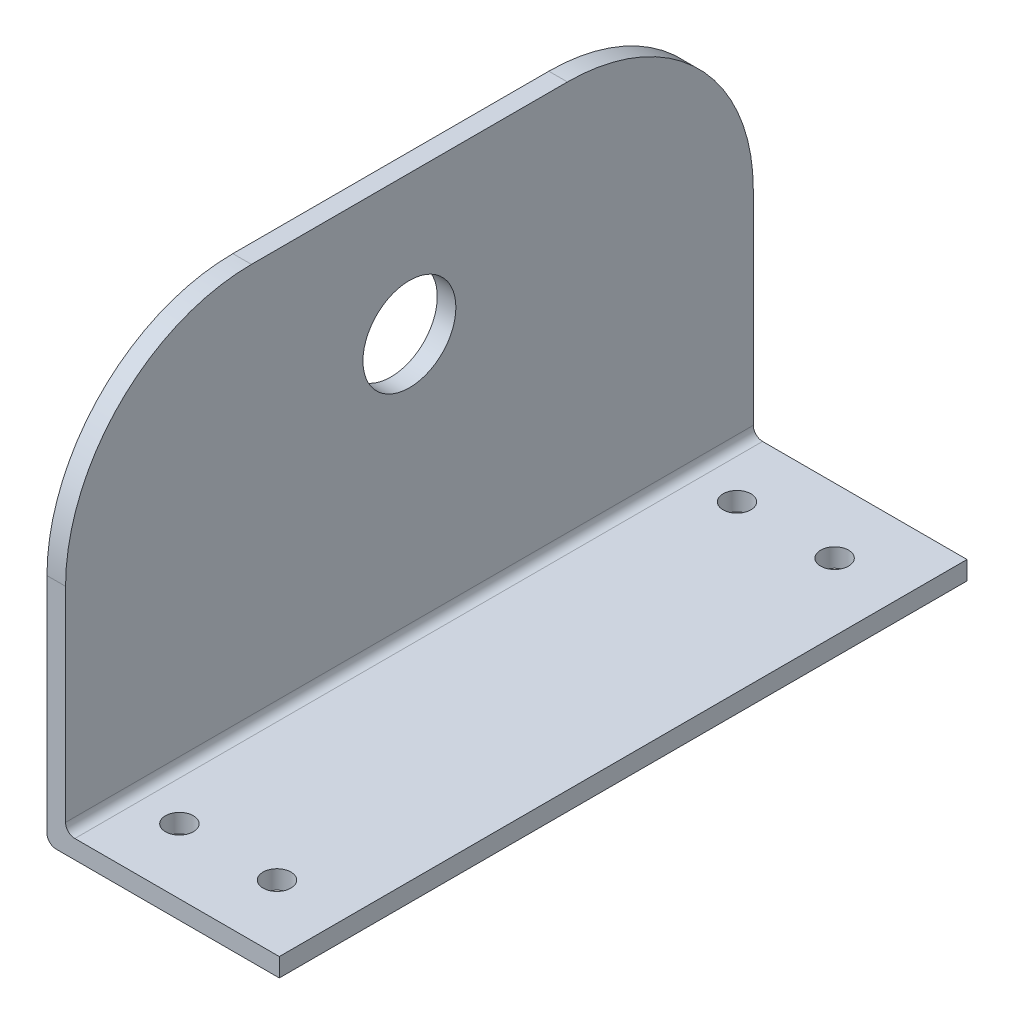
ISO-10303-21;
HEADER;
FILE_DESCRIPTION(('STEP AP214'),'2;1');
FILE_NAME('part.step','',(''),(''),'','','');
FILE_SCHEMA(('AUTOMOTIVE_DESIGN { 1 0 10303 214 1 1 1 1 }'));
ENDSEC;
DATA;
#1=APPLICATION_CONTEXT('core data for automotive mechanical design processes');
#2=APPLICATION_PROTOCOL_DEFINITION('international standard','automotive_design',2000,#1);
#3=PRODUCT_CONTEXT('',#1,'mechanical');
#4=PRODUCT('Part','Part','',(#3));
#5=PRODUCT_RELATED_PRODUCT_CATEGORY('part','',(#4));
#6=PRODUCT_DEFINITION_FORMATION('','',#4);
#7=PRODUCT_DEFINITION_CONTEXT('part definition',#1,'design');
#8=PRODUCT_DEFINITION('design','',#6,#7);
#9=PRODUCT_DEFINITION_SHAPE('','',#8);
#10=(LENGTH_UNIT() NAMED_UNIT(*) SI_UNIT(.MILLI.,.METRE.));
#11=(NAMED_UNIT(*) PLANE_ANGLE_UNIT() SI_UNIT($,.RADIAN.));
#12=(NAMED_UNIT(*) SI_UNIT($,.STERADIAN.) SOLID_ANGLE_UNIT());
#13=UNCERTAINTY_MEASURE_WITH_UNIT(LENGTH_MEASURE(1.E-05),#10,'distance_accuracy_value','');
#14=(GEOMETRIC_REPRESENTATION_CONTEXT(3) GLOBAL_UNCERTAINTY_ASSIGNED_CONTEXT((#13)) GLOBAL_UNIT_ASSIGNED_CONTEXT((#10,
#11,#12)) REPRESENTATION_CONTEXT('',''));
#15=CARTESIAN_POINT('',(0.,0.,0.));
#16=DIRECTION('',(0.,0.,1.));
#17=DIRECTION('',(1.,0.,0.));
#18=AXIS2_PLACEMENT_3D('',#15,#16,#17);
#19=CARTESIAN_POINT('',(0.,2.,0.));
#20=DIRECTION('',(0.,0.,-1.));
#21=DIRECTION('',(-1.,0.,0.));
#22=AXIS2_PLACEMENT_3D('',#19,#20,#21);
#23=PLANE('',#22);
#24=DIRECTION('',(0.,-1.,0.));
#25=VECTOR('',#24,1.);
#26=CARTESIAN_POINT('',(2.00000000000001,45.,0.));
#27=LINE('',#26,#25);
#28=CARTESIAN_POINT('',(2.00000000000001,25.,0.));
#29=VERTEX_POINT('',#28);
#30=CARTESIAN_POINT('',(2.00000000000001,3.00000000000002,0.));
#31=VERTEX_POINT('',#30);
#32=EDGE_CURVE('E201',#29,#31,#27,.T.);
#33=ORIENTED_EDGE('',*,*,#32,.F.);
#34=DIRECTION('',(1.,0.,0.));
#35=VECTOR('',#34,1.);
#36=CARTESIAN_POINT('',(0.,25.,0.));
#37=LINE('',#36,#35);
#38=CARTESIAN_POINT('',(0.,25.,0.));
#39=VERTEX_POINT('',#38);
#40=EDGE_CURVE('E11',#29,#39,#37,.F.);
#41=ORIENTED_EDGE('',*,*,#40,.T.);
#42=DIRECTION('',(0.,-1.,0.));
#43=VECTOR('',#42,1.);
#44=CARTESIAN_POINT('',(0.,45.,0.));
#45=LINE('',#44,#43);
#46=CARTESIAN_POINT('',(0.,1.00000000000001,0.));
#47=VERTEX_POINT('',#46);
#48=EDGE_CURVE('E190',#39,#47,#45,.T.);
#49=ORIENTED_EDGE('',*,*,#48,.T.);
#50=CARTESIAN_POINT('',(1.,1.,0.));
#51=DIRECTION('',(0.,0.,-1.));
#52=DIRECTION('',(-1.,0.,0.));
#53=AXIS2_PLACEMENT_3D('',#50,#51,#52);
#54=CIRCLE('',#53,1.);
#55=CARTESIAN_POINT('',(1.,0.,0.));
#56=VERTEX_POINT('',#55);
#57=EDGE_CURVE('E158',#47,#56,#54,.F.);
#58=ORIENTED_EDGE('',*,*,#57,.T.);
#59=DIRECTION('',(1.,0.,0.));
#60=VECTOR('',#59,1.);
#61=CARTESIAN_POINT('',(0.,0.,0.));
#62=LINE('',#61,#60);
#63=CARTESIAN_POINT('',(25.,0.,0.));
#64=VERTEX_POINT('',#63);
#65=EDGE_CURVE('E138',#56,#64,#62,.T.);
#66=ORIENTED_EDGE('',*,*,#65,.T.);
#67=DIRECTION('',(0.,-1.,0.));
#68=VECTOR('',#67,1.);
#69=CARTESIAN_POINT('',(25.,2.,0.));
#70=LINE('',#69,#68);
#71=CARTESIAN_POINT('',(25.,2.,0.));
#72=VERTEX_POINT('',#71);
#73=EDGE_CURVE('E132',#72,#64,#70,.T.);
#74=ORIENTED_EDGE('',*,*,#73,.F.);
#75=DIRECTION('',(1.,0.,0.));
#76=VECTOR('',#75,1.);
#77=CARTESIAN_POINT('',(0.,2.,0.));
#78=LINE('',#77,#76);
#79=CARTESIAN_POINT('',(3.00000000000001,2.,0.));
#80=VERTEX_POINT('',#79);
#81=EDGE_CURVE('E115',#80,#72,#78,.T.);
#82=ORIENTED_EDGE('',*,*,#81,.F.);
#83=CARTESIAN_POINT('',(3.00000000000001,3.,0.));
#84=DIRECTION('',(0.,0.,-1.));
#85=DIRECTION('',(-1.,0.,0.));
#86=AXIS2_PLACEMENT_3D('',#83,#84,#85);
#87=CIRCLE('',#86,1.);
#88=EDGE_CURVE('E160',#80,#31,#87,.T.);
#89=ORIENTED_EDGE('',*,*,#88,.T.);
#90=EDGE_LOOP('',(#33,#41,#49,#58,#66,#74,#82,#89));
#91=FACE_BOUND('',#90,.T.);
#92=ADVANCED_FACE('F36',(#91),#23,.F.);
#93=CARTESIAN_POINT('',(25.,2.,0.));
#94=DIRECTION('',(-1.,0.,0.));
#95=DIRECTION('',(0.,0.,1.));
#96=AXIS2_PLACEMENT_3D('',#93,#94,#95);
#97=PLANE('',#96);
#98=DIRECTION('',(0.,0.,-1.));
#99=VECTOR('',#98,1.);
#100=CARTESIAN_POINT('',(25.,0.,0.));
#101=LINE('',#100,#99);
#102=CARTESIAN_POINT('',(25.,0.,-74.));
#103=VERTEX_POINT('',#102);
#104=EDGE_CURVE('E230',#64,#103,#101,.T.);
#105=ORIENTED_EDGE('',*,*,#104,.T.);
#106=DIRECTION('',(0.,-1.,0.));
#107=VECTOR('',#106,1.);
#108=CARTESIAN_POINT('',(25.,2.,-74.));
#109=LINE('',#108,#107);
#110=CARTESIAN_POINT('',(25.,2.,-74.));
#111=VERTEX_POINT('',#110);
#112=EDGE_CURVE('E134',#111,#103,#109,.T.);
#113=ORIENTED_EDGE('',*,*,#112,.F.);
#114=DIRECTION('',(0.,0.,-1.));
#115=VECTOR('',#114,1.);
#116=CARTESIAN_POINT('',(25.,2.,0.));
#117=LINE('',#116,#115);
#118=EDGE_CURVE('E120',#72,#111,#117,.T.);
#119=ORIENTED_EDGE('',*,*,#118,.F.);
#120=ORIENTED_EDGE('',*,*,#73,.T.);
#121=EDGE_LOOP('',(#105,#113,#119,#120));
#122=FACE_BOUND('',#121,.T.);
#123=ADVANCED_FACE('F131',(#122),#97,.F.);
#124=CARTESIAN_POINT('',(0.,2.,-74.));
#125=DIRECTION('',(0.,0.,-1.));
#126=DIRECTION('',(-1.,0.,0.));
#127=AXIS2_PLACEMENT_3D('',#124,#125,#126);
#128=PLANE('',#127);
#129=DIRECTION('',(0.,-1.,0.));
#130=VECTOR('',#129,1.);
#131=CARTESIAN_POINT('',(0.,45.,-74.));
#132=LINE('',#131,#130);
#133=CARTESIAN_POINT('',(0.,25.,-74.));
#134=VERTEX_POINT('',#133);
#135=CARTESIAN_POINT('',(0.,1.00000000000001,-74.));
#136=VERTEX_POINT('',#135);
#137=EDGE_CURVE('E180',#134,#136,#132,.T.);
#138=ORIENTED_EDGE('',*,*,#137,.F.);
#139=DIRECTION('',(1.,0.,0.));
#140=VECTOR('',#139,1.);
#141=CARTESIAN_POINT('',(0.,25.,-74.));
#142=LINE('',#141,#140);
#143=CARTESIAN_POINT('',(2.,25.,-74.));
#144=VERTEX_POINT('',#143);
#145=EDGE_CURVE('E164',#134,#144,#142,.T.);
#146=ORIENTED_EDGE('',*,*,#145,.T.);
#147=DIRECTION('',(0.,-1.,0.));
#148=VECTOR('',#147,1.);
#149=CARTESIAN_POINT('',(2.,45.,-74.));
#150=LINE('',#149,#148);
#151=CARTESIAN_POINT('',(2.,3.00000000000002,-74.));
#152=VERTEX_POINT('',#151);
#153=EDGE_CURVE('E197',#144,#152,#150,.T.);
#154=ORIENTED_EDGE('',*,*,#153,.T.);
#155=CARTESIAN_POINT('',(3.,3.,-74.));
#156=DIRECTION('',(0.,0.,-1.));
#157=DIRECTION('',(-1.,0.,0.));
#158=AXIS2_PLACEMENT_3D('',#155,#156,#157);
#159=CIRCLE('',#158,1.);
#160=CARTESIAN_POINT('',(3.,2.,-74.));
#161=VERTEX_POINT('',#160);
#162=EDGE_CURVE('E162',#152,#161,#159,.F.);
#163=ORIENTED_EDGE('',*,*,#162,.T.);
#164=DIRECTION('',(1.,0.,0.));
#165=VECTOR('',#164,1.);
#166=CARTESIAN_POINT('',(0.,2.,-74.));
#167=LINE('',#166,#165);
#168=EDGE_CURVE('E135',#161,#111,#167,.T.);
#169=ORIENTED_EDGE('',*,*,#168,.T.);
#170=ORIENTED_EDGE('',*,*,#112,.T.);
#171=DIRECTION('',(1.,0.,0.));
#172=VECTOR('',#171,1.);
#173=CARTESIAN_POINT('',(0.,0.,-74.));
#174=LINE('',#173,#172);
#175=CARTESIAN_POINT('',(1.,0.,-74.));
#176=VERTEX_POINT('',#175);
#177=EDGE_CURVE('E232',#176,#103,#174,.T.);
#178=ORIENTED_EDGE('',*,*,#177,.F.);
#179=CARTESIAN_POINT('',(1.,1.,-74.));
#180=DIRECTION('',(0.,0.,-1.));
#181=DIRECTION('',(-1.,0.,0.));
#182=AXIS2_PLACEMENT_3D('',#179,#180,#181);
#183=CIRCLE('',#182,1.);
#184=EDGE_CURVE('E152',#176,#136,#183,.T.);
#185=ORIENTED_EDGE('',*,*,#184,.T.);
#186=EDGE_LOOP('',(#138,#146,#154,#163,#169,#170,#178,#185));
#187=FACE_BOUND('',#186,.T.);
#188=ADVANCED_FACE('F185',(#187),#128,.T.);
#189=CARTESIAN_POINT('',(17.75,2.,-67.));
#190=DIRECTION('',(0.,-1.,0.));
#191=DIRECTION('',(0.,0.,-1.));
#192=AXIS2_PLACEMENT_3D('',#189,#190,#191);
#193=CYLINDRICAL_SURFACE('',#192,1.5);
#194=CARTESIAN_POINT('',(17.75,2.,-67.));
#195=DIRECTION('',(0.,1.,0.));
#196=DIRECTION('',(0.,0.,1.));
#197=AXIS2_PLACEMENT_3D('',#194,#195,#196);
#198=CIRCLE('',#197,1.5);
#199=CARTESIAN_POINT('',(17.75,2.,-65.5));
#200=VERTEX_POINT('',#199);
#201=EDGE_CURVE('E126',#200,#200,#198,.T.);
#202=ORIENTED_EDGE('',*,*,#201,.T.);
#203=EDGE_LOOP('',(#202));
#204=FACE_BOUND('',#203,.T.);
#205=CARTESIAN_POINT('',(17.75,0.,-67.));
#206=DIRECTION('',(0.,1.,0.));
#207=DIRECTION('',(0.,0.,1.));
#208=AXIS2_PLACEMENT_3D('',#205,#206,#207);
#209=CIRCLE('',#208,1.5);
#210=CARTESIAN_POINT('',(17.75,0.,-65.5));
#211=VERTEX_POINT('',#210);
#212=EDGE_CURVE('E226',#211,#211,#209,.T.);
#213=ORIENTED_EDGE('',*,*,#212,.F.);
#214=EDGE_LOOP('',(#213));
#215=FACE_BOUND('',#214,.T.);
#216=ADVANCED_FACE('F260',(#204,#215),#193,.F.);
#217=CARTESIAN_POINT('',(7.25,2.,-67.));
#218=DIRECTION('',(0.,-1.,0.));
#219=DIRECTION('',(0.,0.,-1.));
#220=AXIS2_PLACEMENT_3D('',#217,#218,#219);
#221=CYLINDRICAL_SURFACE('',#220,1.5);
#222=CARTESIAN_POINT('',(7.25,2.,-67.));
#223=DIRECTION('',(0.,1.,0.));
#224=DIRECTION('',(0.,0.,1.));
#225=AXIS2_PLACEMENT_3D('',#222,#223,#224);
#226=CIRCLE('',#225,1.5);
#227=CARTESIAN_POINT('',(7.25,2.,-65.5));
#228=VERTEX_POINT('',#227);
#229=EDGE_CURVE('E212',#228,#228,#226,.F.);
#230=ORIENTED_EDGE('',*,*,#229,.F.);
#231=EDGE_LOOP('',(#230));
#232=FACE_BOUND('',#231,.T.);
#233=CARTESIAN_POINT('',(7.25,0.,-67.));
#234=DIRECTION('',(0.,1.,0.));
#235=DIRECTION('',(0.,0.,1.));
#236=AXIS2_PLACEMENT_3D('',#233,#234,#235);
#237=CIRCLE('',#236,1.5);
#238=CARTESIAN_POINT('',(7.25,0.,-65.5));
#239=VERTEX_POINT('',#238);
#240=EDGE_CURVE('E223',#239,#239,#237,.F.);
#241=ORIENTED_EDGE('',*,*,#240,.T.);
#242=EDGE_LOOP('',(#241));
#243=FACE_BOUND('',#242,.T.);
#244=ADVANCED_FACE('F263',(#232,#243),#221,.F.);
#245=CARTESIAN_POINT('',(7.25000000000001,2.,-7.));
#246=DIRECTION('',(0.,-1.,0.));
#247=DIRECTION('',(0.,0.,-1.));
#248=AXIS2_PLACEMENT_3D('',#245,#246,#247);
#249=CYLINDRICAL_SURFACE('',#248,1.5);
#250=CARTESIAN_POINT('',(7.25000000000001,2.,-7.));
#251=DIRECTION('',(0.,1.,0.));
#252=DIRECTION('',(0.,0.,1.));
#253=AXIS2_PLACEMENT_3D('',#250,#251,#252);
#254=CIRCLE('',#253,1.5);
#255=CARTESIAN_POINT('',(7.25000000000001,2.,-5.5));
#256=VERTEX_POINT('',#255);
#257=EDGE_CURVE('E209',#256,#256,#254,.T.);
#258=ORIENTED_EDGE('',*,*,#257,.T.);
#259=EDGE_LOOP('',(#258));
#260=FACE_BOUND('',#259,.T.);
#261=CARTESIAN_POINT('',(7.25000000000001,0.,-7.));
#262=DIRECTION('',(0.,1.,0.));
#263=DIRECTION('',(0.,0.,1.));
#264=AXIS2_PLACEMENT_3D('',#261,#262,#263);
#265=CIRCLE('',#264,1.5);
#266=CARTESIAN_POINT('',(7.25000000000001,0.,-5.5));
#267=VERTEX_POINT('',#266);
#268=EDGE_CURVE('E189',#267,#267,#265,.T.);
#269=ORIENTED_EDGE('',*,*,#268,.F.);
#270=EDGE_LOOP('',(#269));
#271=FACE_BOUND('',#270,.T.);
#272=ADVANCED_FACE('F267',(#260,#271),#249,.F.);
#273=CARTESIAN_POINT('',(17.75,2.,-7.));
#274=DIRECTION('',(0.,-1.,0.));
#275=DIRECTION('',(0.,0.,-1.));
#276=AXIS2_PLACEMENT_3D('',#273,#274,#275);
#277=CYLINDRICAL_SURFACE('',#276,1.5);
#278=CARTESIAN_POINT('',(17.75,2.,-7.));
#279=DIRECTION('',(0.,1.,0.));
#280=DIRECTION('',(0.,0.,1.));
#281=AXIS2_PLACEMENT_3D('',#278,#279,#280);
#282=CIRCLE('',#281,1.5);
#283=CARTESIAN_POINT('',(17.75,2.,-5.5));
#284=VERTEX_POINT('',#283);
#285=EDGE_CURVE('E143',#284,#284,#282,.F.);
#286=ORIENTED_EDGE('',*,*,#285,.F.);
#287=EDGE_LOOP('',(#286));
#288=FACE_BOUND('',#287,.T.);
#289=CARTESIAN_POINT('',(17.75,0.,-7.));
#290=DIRECTION('',(0.,1.,0.));
#291=DIRECTION('',(0.,0.,1.));
#292=AXIS2_PLACEMENT_3D('',#289,#290,#291);
#293=CIRCLE('',#292,1.5);
#294=CARTESIAN_POINT('',(17.75,0.,-5.5));
#295=VERTEX_POINT('',#294);
#296=EDGE_CURVE('E213',#295,#295,#293,.F.);
#297=ORIENTED_EDGE('',*,*,#296,.T.);
#298=EDGE_LOOP('',(#297));
#299=FACE_BOUND('',#298,.T.);
#300=ADVANCED_FACE('F236',(#288,#299),#277,.F.);
#301=CARTESIAN_POINT('',(0.,2.,0.));
#302=DIRECTION('',(0.,1.,0.));
#303=DIRECTION('',(0.,0.,1.));
#304=AXIS2_PLACEMENT_3D('',#301,#302,#303);
#305=PLANE('',#304);
#306=ORIENTED_EDGE('',*,*,#257,.F.);
#307=EDGE_LOOP('',(#306));
#308=FACE_BOUND('',#307,.T.);
#309=ORIENTED_EDGE('',*,*,#229,.T.);
#310=EDGE_LOOP('',(#309));
#311=FACE_BOUND('',#310,.T.);
#312=ORIENTED_EDGE('',*,*,#201,.F.);
#313=EDGE_LOOP('',(#312));
#314=FACE_BOUND('',#313,.T.);
#315=ORIENTED_EDGE('',*,*,#168,.F.);
#316=DIRECTION('',(0.,0.,1.));
#317=VECTOR('',#316,1.);
#318=CARTESIAN_POINT('',(3.00000000000001,2.,0.));
#319=LINE('',#318,#317);
#320=EDGE_CURVE('E123',#161,#80,#319,.T.);
#321=ORIENTED_EDGE('',*,*,#320,.T.);
#322=ORIENTED_EDGE('',*,*,#81,.T.);
#323=ORIENTED_EDGE('',*,*,#118,.T.);
#324=EDGE_LOOP('',(#315,#321,#322,#323));
#325=FACE_BOUND('',#324,.T.);
#326=ORIENTED_EDGE('',*,*,#285,.T.);
#327=EDGE_LOOP('',(#326));
#328=FACE_BOUND('',#327,.T.);
#329=ADVANCED_FACE('F118',(#308,#311,#314,#325,#328),#305,.T.);
#330=CARTESIAN_POINT('',(0.,0.,0.));
#331=DIRECTION('',(0.,1.,0.));
#332=DIRECTION('',(0.,0.,1.));
#333=AXIS2_PLACEMENT_3D('',#330,#331,#332);
#334=PLANE('',#333);
#335=ORIENTED_EDGE('',*,*,#268,.T.);
#336=EDGE_LOOP('',(#335));
#337=FACE_BOUND('',#336,.T.);
#338=ORIENTED_EDGE('',*,*,#240,.F.);
#339=EDGE_LOOP('',(#338));
#340=FACE_BOUND('',#339,.T.);
#341=ORIENTED_EDGE('',*,*,#212,.T.);
#342=EDGE_LOOP('',(#341));
#343=FACE_BOUND('',#342,.T.);
#344=ORIENTED_EDGE('',*,*,#65,.F.);
#345=DIRECTION('',(0.,0.,-1.));
#346=VECTOR('',#345,1.);
#347=CARTESIAN_POINT('',(1.,0.,-74.));
#348=LINE('',#347,#346);
#349=EDGE_CURVE('E149',#56,#176,#348,.T.);
#350=ORIENTED_EDGE('',*,*,#349,.T.);
#351=ORIENTED_EDGE('',*,*,#177,.T.);
#352=ORIENTED_EDGE('',*,*,#104,.F.);
#353=EDGE_LOOP('',(#344,#350,#351,#352));
#354=FACE_BOUND('',#353,.T.);
#355=ORIENTED_EDGE('',*,*,#296,.F.);
#356=EDGE_LOOP('',(#355));
#357=FACE_BOUND('',#356,.T.);
#358=ADVANCED_FACE('F238',(#337,#340,#343,#354,#357),#334,.F.);
#359=CARTESIAN_POINT('',(2.00000000000001,45.,0.));
#360=DIRECTION('',(1.,0.,0.));
#361=DIRECTION('',(0.,0.,-1.));
#362=AXIS2_PLACEMENT_3D('',#359,#360,#361);
#363=PLANE('',#362);
#364=CARTESIAN_POINT('',(2.,30.,-37.));
#365=DIRECTION('',(1.,0.,0.));
#366=DIRECTION('',(0.,0.,-1.));
#367=AXIS2_PLACEMENT_3D('',#364,#365,#366);
#368=CIRCLE('',#367,5.);
#369=CARTESIAN_POINT('',(2.,30.,-42.));
#370=VERTEX_POINT('',#369);
#371=EDGE_CURVE('E203',#370,#370,#368,.F.);
#372=ORIENTED_EDGE('',*,*,#371,.T.);
#373=EDGE_LOOP('',(#372));
#374=FACE_BOUND('',#373,.T.);
#375=ORIENTED_EDGE('',*,*,#153,.F.);
#376=CARTESIAN_POINT('',(2.,25.,-54.));
#377=DIRECTION('',(1.,0.,0.));
#378=DIRECTION('',(0.,0.,-1.));
#379=AXIS2_PLACEMENT_3D('',#376,#377,#378);
#380=CIRCLE('',#379,20.);
#381=CARTESIAN_POINT('',(2.,45.,-54.));
#382=VERTEX_POINT('',#381);
#383=EDGE_CURVE('E169',#144,#382,#380,.T.);
#384=ORIENTED_EDGE('',*,*,#383,.T.);
#385=DIRECTION('',(0.,0.,1.));
#386=VECTOR('',#385,1.);
#387=CARTESIAN_POINT('',(2.00000000000001,45.,0.));
#388=LINE('',#387,#386);
#389=CARTESIAN_POINT('',(2.00000000000001,45.,-20.));
#390=VERTEX_POINT('',#389);
#391=EDGE_CURVE('E196',#382,#390,#388,.T.);
#392=ORIENTED_EDGE('',*,*,#391,.T.);
#393=CARTESIAN_POINT('',(2.00000000000001,25.,-20.));
#394=DIRECTION('',(1.,0.,0.));
#395=DIRECTION('',(0.,0.,-1.));
#396=AXIS2_PLACEMENT_3D('',#393,#394,#395);
#397=CIRCLE('',#396,20.);
#398=EDGE_CURVE('E167',#390,#29,#397,.T.);
#399=ORIENTED_EDGE('',*,*,#398,.T.);
#400=ORIENTED_EDGE('',*,*,#32,.T.);
#401=DIRECTION('',(0.,0.,1.));
#402=VECTOR('',#401,1.);
#403=CARTESIAN_POINT('',(2.,3.,-74.));
#404=LINE('',#403,#402);
#405=EDGE_CURVE('E141',#31,#152,#404,.F.);
#406=ORIENTED_EDGE('',*,*,#405,.T.);
#407=EDGE_LOOP('',(#375,#384,#392,#399,#400,#406));
#408=FACE_BOUND('',#407,.T.);
#409=ADVANCED_FACE('F195',(#374,#408),#363,.T.);
#410=CARTESIAN_POINT('',(0.,45.,0.));
#411=DIRECTION('',(-1.,0.,0.));
#412=DIRECTION('',(0.,0.,1.));
#413=AXIS2_PLACEMENT_3D('',#410,#411,#412);
#414=PLANE('',#413);
#415=CARTESIAN_POINT('',(0.,30.,-37.));
#416=DIRECTION('',(-1.,0.,0.));
#417=DIRECTION('',(0.,0.,1.));
#418=AXIS2_PLACEMENT_3D('',#415,#416,#417);
#419=CIRCLE('',#418,5.);
#420=CARTESIAN_POINT('',(0.,30.,-32.));
#421=VERTEX_POINT('',#420);
#422=EDGE_CURVE('E308',#421,#421,#419,.T.);
#423=ORIENTED_EDGE('',*,*,#422,.F.);
#424=EDGE_LOOP('',(#423));
#425=FACE_BOUND('',#424,.T.);
#426=DIRECTION('',(0.,0.,-1.));
#427=VECTOR('',#426,1.);
#428=CARTESIAN_POINT('',(0.,45.,0.));
#429=LINE('',#428,#427);
#430=CARTESIAN_POINT('',(0.,45.,-20.));
#431=VERTEX_POINT('',#430);
#432=CARTESIAN_POINT('',(0.,45.,-54.));
#433=VERTEX_POINT('',#432);
#434=EDGE_CURVE('E181',#431,#433,#429,.T.);
#435=ORIENTED_EDGE('',*,*,#434,.T.);
#436=CARTESIAN_POINT('',(0.,25.,-54.));
#437=DIRECTION('',(-1.,0.,0.));
#438=DIRECTION('',(0.,0.,1.));
#439=AXIS2_PLACEMENT_3D('',#436,#437,#438);
#440=CIRCLE('',#439,20.);
#441=EDGE_CURVE('E44',#433,#134,#440,.T.);
#442=ORIENTED_EDGE('',*,*,#441,.T.);
#443=ORIENTED_EDGE('',*,*,#137,.T.);
#444=DIRECTION('',(0.,0.,-1.));
#445=VECTOR('',#444,1.);
#446=CARTESIAN_POINT('',(0.,1.,0.));
#447=LINE('',#446,#445);
#448=EDGE_CURVE('E155',#136,#47,#447,.F.);
#449=ORIENTED_EDGE('',*,*,#448,.T.);
#450=ORIENTED_EDGE('',*,*,#48,.F.);
#451=CARTESIAN_POINT('',(0.,25.,-20.));
#452=DIRECTION('',(-1.,0.,0.));
#453=DIRECTION('',(0.,0.,1.));
#454=AXIS2_PLACEMENT_3D('',#451,#452,#453);
#455=CIRCLE('',#454,20.);
#456=EDGE_CURVE('E175',#39,#431,#455,.T.);
#457=ORIENTED_EDGE('',*,*,#456,.T.);
#458=EDGE_LOOP('',(#435,#442,#443,#449,#450,#457));
#459=FACE_BOUND('',#458,.T.);
#460=ADVANCED_FACE('F179',(#425,#459),#414,.T.);
#461=CARTESIAN_POINT('',(0.,45.,0.));
#462=DIRECTION('',(0.,1.,0.));
#463=DIRECTION('',(0.,0.,1.));
#464=AXIS2_PLACEMENT_3D('',#461,#462,#463);
#465=PLANE('',#464);
#466=ORIENTED_EDGE('',*,*,#391,.F.);
#467=DIRECTION('',(1.,0.,0.));
#468=VECTOR('',#467,1.);
#469=CARTESIAN_POINT('',(0.,45.,-54.));
#470=LINE('',#469,#468);
#471=EDGE_CURVE('E57',#382,#433,#470,.F.);
#472=ORIENTED_EDGE('',*,*,#471,.T.);
#473=ORIENTED_EDGE('',*,*,#434,.F.);
#474=DIRECTION('',(1.,0.,0.));
#475=VECTOR('',#474,1.);
#476=CARTESIAN_POINT('',(2.00000000000001,45.,-20.));
#477=LINE('',#476,#475);
#478=EDGE_CURVE('E171',#431,#390,#477,.T.);
#479=ORIENTED_EDGE('',*,*,#478,.T.);
#480=EDGE_LOOP('',(#466,#472,#473,#479));
#481=FACE_BOUND('',#480,.T.);
#482=ADVANCED_FACE('F198',(#481),#465,.T.);
#483=CARTESIAN_POINT('',(3.00000000000001,3.,0.));
#484=DIRECTION('',(0.,0.,-1.));
#485=DIRECTION('',(-1.,0.,0.));
#486=AXIS2_PLACEMENT_3D('',#483,#484,#485);
#487=CYLINDRICAL_SURFACE('',#486,1.);
#488=ORIENTED_EDGE('',*,*,#162,.F.);
#489=ORIENTED_EDGE('',*,*,#405,.F.);
#490=ORIENTED_EDGE('',*,*,#88,.F.);
#491=ORIENTED_EDGE('',*,*,#320,.F.);
#492=EDGE_LOOP('',(#488,#489,#490,#491));
#493=FACE_BOUND('',#492,.T.);
#494=ADVANCED_FACE('F272',(#493),#487,.F.);
#495=CARTESIAN_POINT('',(1.,1.,0.));
#496=DIRECTION('',(0.,0.,1.));
#497=DIRECTION('',(1.,0.,0.));
#498=AXIS2_PLACEMENT_3D('',#495,#496,#497);
#499=CYLINDRICAL_SURFACE('',#498,1.);
#500=ORIENTED_EDGE('',*,*,#57,.F.);
#501=ORIENTED_EDGE('',*,*,#448,.F.);
#502=ORIENTED_EDGE('',*,*,#184,.F.);
#503=ORIENTED_EDGE('',*,*,#349,.F.);
#504=EDGE_LOOP('',(#500,#501,#502,#503));
#505=FACE_BOUND('',#504,.T.);
#506=ADVANCED_FACE('F275',(#505),#499,.T.);
#507=CARTESIAN_POINT('',(0.,25.,-54.));
#508=DIRECTION('',(1.,0.,0.));
#509=DIRECTION('',(0.,0.,-1.));
#510=AXIS2_PLACEMENT_3D('',#507,#508,#509);
#511=CYLINDRICAL_SURFACE('',#510,20.);
#512=ORIENTED_EDGE('',*,*,#441,.F.);
#513=ORIENTED_EDGE('',*,*,#471,.F.);
#514=ORIENTED_EDGE('',*,*,#383,.F.);
#515=ORIENTED_EDGE('',*,*,#145,.F.);
#516=EDGE_LOOP('',(#512,#513,#514,#515));
#517=FACE_BOUND('',#516,.T.);
#518=ADVANCED_FACE('F192',(#517),#511,.T.);
#519=CARTESIAN_POINT('',(0.,25.,-20.));
#520=DIRECTION('',(-1.,0.,0.));
#521=DIRECTION('',(0.,0.,1.));
#522=AXIS2_PLACEMENT_3D('',#519,#520,#521);
#523=CYLINDRICAL_SURFACE('',#522,20.);
#524=ORIENTED_EDGE('',*,*,#456,.F.);
#525=ORIENTED_EDGE('',*,*,#40,.F.);
#526=ORIENTED_EDGE('',*,*,#398,.F.);
#527=ORIENTED_EDGE('',*,*,#478,.F.);
#528=EDGE_LOOP('',(#524,#525,#526,#527));
#529=FACE_BOUND('',#528,.T.);
#530=ADVANCED_FACE('F38',(#529),#523,.T.);
#531=CARTESIAN_POINT('',(16.1421356237309,30.,-37.));
#532=DIRECTION('',(-1.,0.,0.));
#533=DIRECTION('',(0.,0.,1.));
#534=AXIS2_PLACEMENT_3D('',#531,#532,#533);
#535=CYLINDRICAL_SURFACE('',#534,5.);
#536=ORIENTED_EDGE('',*,*,#422,.T.);
#537=EDGE_LOOP('',(#536));
#538=FACE_BOUND('',#537,.T.);
#539=ORIENTED_EDGE('',*,*,#371,.F.);
#540=EDGE_LOOP('',(#539));
#541=FACE_BOUND('',#540,.T.);
#542=ADVANCED_FACE('F283',(#538,#541),#535,.F.);
#543=CLOSED_SHELL('',(#92,#123,#188,#216,#244,#272,#300,#329,#358,#409,#460,#482,#494,#506,#518,
#530,#542));
#544=MANIFOLD_SOLID_BREP('B2',#543);
#545=ADVANCED_BREP_SHAPE_REPRESENTATION('',(#18,#544),#14);
#546=SHAPE_DEFINITION_REPRESENTATION(#9,#545);
ENDSEC;
END-ISO-10303-21;
